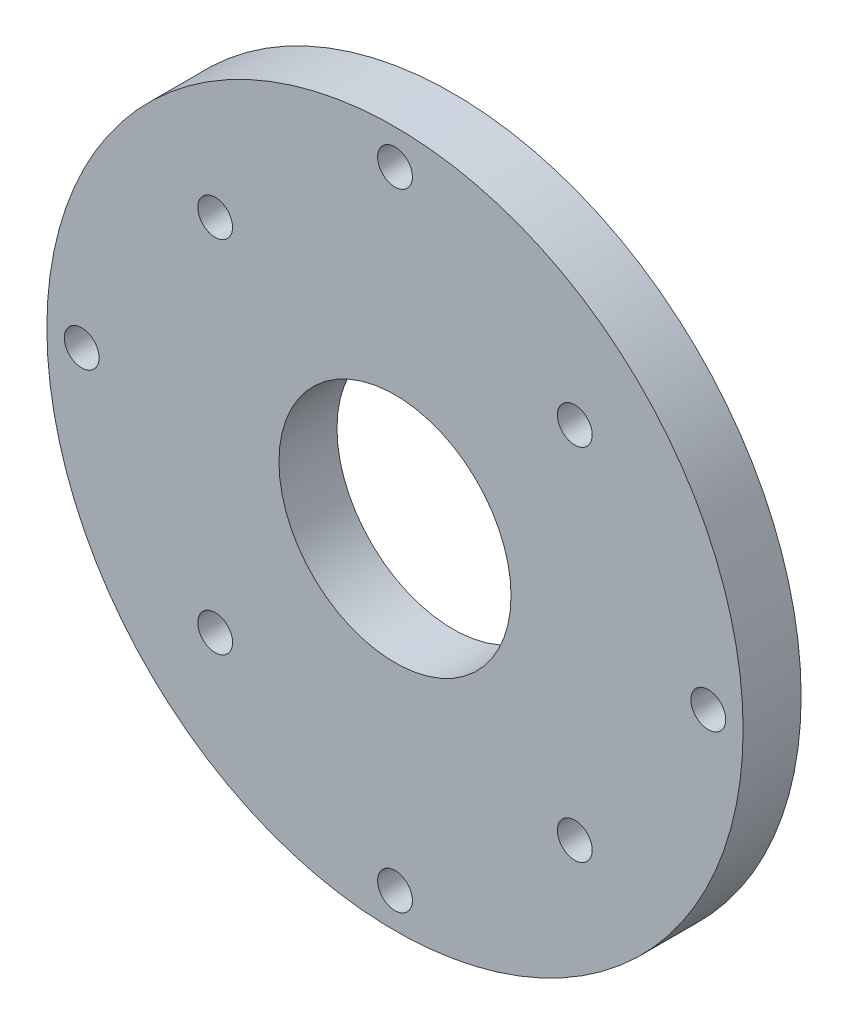
ISO-10303-21;
HEADER;
FILE_DESCRIPTION(('STEP AP214'),'2;1');
FILE_NAME('part.step','',(''),(''),'','','');
FILE_SCHEMA(('AUTOMOTIVE_DESIGN { 1 0 10303 214 1 1 1 1 }'));
ENDSEC;
DATA;
#1=APPLICATION_CONTEXT('core data for automotive mechanical design processes');
#2=APPLICATION_PROTOCOL_DEFINITION('international standard','automotive_design',2000,#1);
#3=PRODUCT_CONTEXT('',#1,'mechanical');
#4=PRODUCT('Part','Part','',(#3));
#5=PRODUCT_RELATED_PRODUCT_CATEGORY('part','',(#4));
#6=PRODUCT_DEFINITION_FORMATION('','',#4);
#7=PRODUCT_DEFINITION_CONTEXT('part definition',#1,'design');
#8=PRODUCT_DEFINITION('design','',#6,#7);
#9=PRODUCT_DEFINITION_SHAPE('','',#8);
#10=(LENGTH_UNIT() NAMED_UNIT(*) SI_UNIT(.MILLI.,.METRE.));
#11=(NAMED_UNIT(*) PLANE_ANGLE_UNIT() SI_UNIT($,.RADIAN.));
#12=(NAMED_UNIT(*) SI_UNIT($,.STERADIAN.) SOLID_ANGLE_UNIT());
#13=UNCERTAINTY_MEASURE_WITH_UNIT(LENGTH_MEASURE(1.E-05),#10,'distance_accuracy_value','');
#14=(GEOMETRIC_REPRESENTATION_CONTEXT(3) GLOBAL_UNCERTAINTY_ASSIGNED_CONTEXT((#13)) GLOBAL_UNIT_ASSIGNED_CONTEXT((#10,
#11,#12)) REPRESENTATION_CONTEXT('',''));
#15=CARTESIAN_POINT('',(0.,0.,0.));
#16=DIRECTION('',(0.,0.,1.));
#17=DIRECTION('',(1.,0.,0.));
#18=AXIS2_PLACEMENT_3D('',#15,#16,#17);
#19=CARTESIAN_POINT('',(0.,0.,5.));
#20=DIRECTION('',(0.,0.,-1.));
#21=DIRECTION('',(-1.,0.,0.));
#22=AXIS2_PLACEMENT_3D('',#19,#20,#21);
#23=CYLINDRICAL_SURFACE('',#22,30.);
#24=CARTESIAN_POINT('',(0.,0.,5.));
#25=DIRECTION('',(0.,0.,1.));
#26=DIRECTION('',(1.,0.,0.));
#27=AXIS2_PLACEMENT_3D('',#24,#25,#26);
#28=CIRCLE('',#27,30.);
#29=CARTESIAN_POINT('',(30.,0.,5.));
#30=VERTEX_POINT('',#29);
#31=EDGE_CURVE('E43',#30,#30,#28,.T.);
#32=ORIENTED_EDGE('',*,*,#31,.F.);
#33=EDGE_LOOP('',(#32));
#34=FACE_BOUND('',#33,.T.);
#35=CARTESIAN_POINT('',(0.,0.,0.));
#36=DIRECTION('',(0.,0.,1.));
#37=DIRECTION('',(1.,0.,0.));
#38=AXIS2_PLACEMENT_3D('',#35,#36,#37);
#39=CIRCLE('',#38,30.);
#40=CARTESIAN_POINT('',(30.,0.,0.));
#41=VERTEX_POINT('',#40);
#42=EDGE_CURVE('E73',#41,#41,#39,.T.);
#43=ORIENTED_EDGE('',*,*,#42,.T.);
#44=EDGE_LOOP('',(#43));
#45=FACE_BOUND('',#44,.T.);
#46=ADVANCED_FACE('F35',(#34,#45),#23,.T.);
#47=CARTESIAN_POINT('',(0.,-27.,5.));
#48=DIRECTION('',(0.,0.,-1.));
#49=DIRECTION('',(-1.,0.,0.));
#50=AXIS2_PLACEMENT_3D('',#47,#48,#49);
#51=CYLINDRICAL_SURFACE('',#50,1.5);
#52=CARTESIAN_POINT('',(0.,-27.,5.));
#53=DIRECTION('',(0.,0.,1.));
#54=DIRECTION('',(1.,0.,0.));
#55=AXIS2_PLACEMENT_3D('',#52,#53,#54);
#56=CIRCLE('',#55,1.5);
#57=CARTESIAN_POINT('',(1.5,-27.,5.));
#58=VERTEX_POINT('',#57);
#59=EDGE_CURVE('E48',#58,#58,#56,.T.);
#60=ORIENTED_EDGE('',*,*,#59,.T.);
#61=EDGE_LOOP('',(#60));
#62=FACE_BOUND('',#61,.T.);
#63=CARTESIAN_POINT('',(0.,-27.,0.));
#64=DIRECTION('',(0.,0.,1.));
#65=DIRECTION('',(1.,0.,0.));
#66=AXIS2_PLACEMENT_3D('',#63,#64,#65);
#67=CIRCLE('',#66,1.5);
#68=CARTESIAN_POINT('',(1.5,-27.,0.));
#69=VERTEX_POINT('',#68);
#70=EDGE_CURVE('E71',#69,#69,#67,.T.);
#71=ORIENTED_EDGE('',*,*,#70,.F.);
#72=EDGE_LOOP('',(#71));
#73=FACE_BOUND('',#72,.T.);
#74=ADVANCED_FACE('F106',(#62,#73),#51,.F.);
#75=CARTESIAN_POINT('',(27.,0.,5.));
#76=DIRECTION('',(0.,0.,-1.));
#77=DIRECTION('',(-1.,0.,0.));
#78=AXIS2_PLACEMENT_3D('',#75,#76,#77);
#79=CYLINDRICAL_SURFACE('',#78,1.5);
#80=CARTESIAN_POINT('',(27.,0.,5.));
#81=DIRECTION('',(0.,0.,1.));
#82=DIRECTION('',(1.,0.,0.));
#83=AXIS2_PLACEMENT_3D('',#80,#81,#82);
#84=CIRCLE('',#83,1.5);
#85=CARTESIAN_POINT('',(28.5,0.,5.));
#86=VERTEX_POINT('',#85);
#87=EDGE_CURVE('E101',#86,#86,#84,.T.);
#88=ORIENTED_EDGE('',*,*,#87,.T.);
#89=EDGE_LOOP('',(#88));
#90=FACE_BOUND('',#89,.T.);
#91=CARTESIAN_POINT('',(27.,0.,0.));
#92=DIRECTION('',(0.,0.,1.));
#93=DIRECTION('',(1.,0.,0.));
#94=AXIS2_PLACEMENT_3D('',#91,#92,#93);
#95=CIRCLE('',#94,1.5);
#96=CARTESIAN_POINT('',(28.5,0.,0.));
#97=VERTEX_POINT('',#96);
#98=EDGE_CURVE('E68',#97,#97,#95,.T.);
#99=ORIENTED_EDGE('',*,*,#98,.F.);
#100=EDGE_LOOP('',(#99));
#101=FACE_BOUND('',#100,.T.);
#102=ADVANCED_FACE('F124',(#90,#101),#79,.F.);
#103=CARTESIAN_POINT('',(0.,27.,5.));
#104=DIRECTION('',(0.,0.,-1.));
#105=DIRECTION('',(-1.,0.,0.));
#106=AXIS2_PLACEMENT_3D('',#103,#104,#105);
#107=CYLINDRICAL_SURFACE('',#106,1.5);
#108=CARTESIAN_POINT('',(0.,27.,5.));
#109=DIRECTION('',(0.,0.,1.));
#110=DIRECTION('',(1.,0.,0.));
#111=AXIS2_PLACEMENT_3D('',#108,#109,#110);
#112=CIRCLE('',#111,1.5);
#113=CARTESIAN_POINT('',(1.5,27.,5.));
#114=VERTEX_POINT('',#113);
#115=EDGE_CURVE('E98',#114,#114,#112,.T.);
#116=ORIENTED_EDGE('',*,*,#115,.T.);
#117=EDGE_LOOP('',(#116));
#118=FACE_BOUND('',#117,.T.);
#119=CARTESIAN_POINT('',(0.,27.,0.));
#120=DIRECTION('',(0.,0.,1.));
#121=DIRECTION('',(1.,0.,0.));
#122=AXIS2_PLACEMENT_3D('',#119,#120,#121);
#123=CIRCLE('',#122,1.5);
#124=CARTESIAN_POINT('',(1.5,27.,0.));
#125=VERTEX_POINT('',#124);
#126=EDGE_CURVE('E65',#125,#125,#123,.T.);
#127=ORIENTED_EDGE('',*,*,#126,.F.);
#128=EDGE_LOOP('',(#127));
#129=FACE_BOUND('',#128,.T.);
#130=ADVANCED_FACE('F131',(#118,#129),#107,.F.);
#131=CARTESIAN_POINT('',(-27.,0.,5.));
#132=DIRECTION('',(0.,0.,-1.));
#133=DIRECTION('',(-1.,0.,0.));
#134=AXIS2_PLACEMENT_3D('',#131,#132,#133);
#135=CYLINDRICAL_SURFACE('',#134,1.5);
#136=CARTESIAN_POINT('',(-27.,0.,5.));
#137=DIRECTION('',(0.,0.,1.));
#138=DIRECTION('',(1.,0.,0.));
#139=AXIS2_PLACEMENT_3D('',#136,#137,#138);
#140=CIRCLE('',#139,1.5);
#141=CARTESIAN_POINT('',(-25.5,0.,5.));
#142=VERTEX_POINT('',#141);
#143=EDGE_CURVE('E95',#142,#142,#140,.T.);
#144=ORIENTED_EDGE('',*,*,#143,.T.);
#145=EDGE_LOOP('',(#144));
#146=FACE_BOUND('',#145,.T.);
#147=CARTESIAN_POINT('',(-27.,0.,0.));
#148=DIRECTION('',(0.,0.,1.));
#149=DIRECTION('',(1.,0.,0.));
#150=AXIS2_PLACEMENT_3D('',#147,#148,#149);
#151=CIRCLE('',#150,1.5);
#152=CARTESIAN_POINT('',(-25.5,0.,0.));
#153=VERTEX_POINT('',#152);
#154=EDGE_CURVE('E62',#153,#153,#151,.T.);
#155=ORIENTED_EDGE('',*,*,#154,.F.);
#156=EDGE_LOOP('',(#155));
#157=FACE_BOUND('',#156,.T.);
#158=ADVANCED_FACE('F135',(#146,#157),#135,.F.);
#159=CARTESIAN_POINT('',(15.495,15.495,5.));
#160=DIRECTION('',(0.,0.,-1.));
#161=DIRECTION('',(-1.,0.,0.));
#162=AXIS2_PLACEMENT_3D('',#159,#160,#161);
#163=CYLINDRICAL_SURFACE('',#162,1.5);
#164=CARTESIAN_POINT('',(15.495,15.495,5.));
#165=DIRECTION('',(0.,0.,1.));
#166=DIRECTION('',(1.,0.,0.));
#167=AXIS2_PLACEMENT_3D('',#164,#165,#166);
#168=CIRCLE('',#167,1.5);
#169=CARTESIAN_POINT('',(16.995,15.495,5.));
#170=VERTEX_POINT('',#169);
#171=EDGE_CURVE('E87',#170,#170,#168,.T.);
#172=ORIENTED_EDGE('',*,*,#171,.T.);
#173=EDGE_LOOP('',(#172));
#174=FACE_BOUND('',#173,.T.);
#175=CARTESIAN_POINT('',(15.495,15.495,0.));
#176=DIRECTION('',(0.,0.,1.));
#177=DIRECTION('',(1.,0.,0.));
#178=AXIS2_PLACEMENT_3D('',#175,#176,#177);
#179=CIRCLE('',#178,1.5);
#180=CARTESIAN_POINT('',(16.995,15.495,0.));
#181=VERTEX_POINT('',#180);
#182=EDGE_CURVE('E59',#181,#181,#179,.T.);
#183=ORIENTED_EDGE('',*,*,#182,.F.);
#184=EDGE_LOOP('',(#183));
#185=FACE_BOUND('',#184,.T.);
#186=ADVANCED_FACE('F139',(#174,#185),#163,.F.);
#187=CARTESIAN_POINT('',(-15.495,15.495,5.));
#188=DIRECTION('',(0.,0.,-1.));
#189=DIRECTION('',(-1.,0.,0.));
#190=AXIS2_PLACEMENT_3D('',#187,#188,#189);
#191=CYLINDRICAL_SURFACE('',#190,1.5);
#192=CARTESIAN_POINT('',(-15.495,15.495,5.));
#193=DIRECTION('',(0.,0.,1.));
#194=DIRECTION('',(1.,0.,0.));
#195=AXIS2_PLACEMENT_3D('',#192,#193,#194);
#196=CIRCLE('',#195,1.5);
#197=CARTESIAN_POINT('',(-13.995,15.495,5.));
#198=VERTEX_POINT('',#197);
#199=EDGE_CURVE('E82',#198,#198,#196,.T.);
#200=ORIENTED_EDGE('',*,*,#199,.T.);
#201=EDGE_LOOP('',(#200));
#202=FACE_BOUND('',#201,.T.);
#203=CARTESIAN_POINT('',(-15.495,15.495,0.));
#204=DIRECTION('',(0.,0.,1.));
#205=DIRECTION('',(1.,0.,0.));
#206=AXIS2_PLACEMENT_3D('',#203,#204,#205);
#207=CIRCLE('',#206,1.5);
#208=CARTESIAN_POINT('',(-13.995,15.495,0.));
#209=VERTEX_POINT('',#208);
#210=EDGE_CURVE('E55',#209,#209,#207,.T.);
#211=ORIENTED_EDGE('',*,*,#210,.F.);
#212=EDGE_LOOP('',(#211));
#213=FACE_BOUND('',#212,.T.);
#214=ADVANCED_FACE('F142',(#202,#213),#191,.F.);
#215=CARTESIAN_POINT('',(15.495,-15.495,5.));
#216=DIRECTION('',(0.,0.,-1.));
#217=DIRECTION('',(-1.,0.,0.));
#218=AXIS2_PLACEMENT_3D('',#215,#216,#217);
#219=CYLINDRICAL_SURFACE('',#218,1.5);
#220=CARTESIAN_POINT('',(15.495,-15.495,5.));
#221=DIRECTION('',(0.,0.,1.));
#222=DIRECTION('',(1.,0.,0.));
#223=AXIS2_PLACEMENT_3D('',#220,#221,#222);
#224=CIRCLE('',#223,1.5);
#225=CARTESIAN_POINT('',(16.995,-15.495,5.));
#226=VERTEX_POINT('',#225);
#227=EDGE_CURVE('E78',#226,#226,#224,.T.);
#228=ORIENTED_EDGE('',*,*,#227,.T.);
#229=EDGE_LOOP('',(#228));
#230=FACE_BOUND('',#229,.T.);
#231=CARTESIAN_POINT('',(15.495,-15.495,0.));
#232=DIRECTION('',(0.,0.,1.));
#233=DIRECTION('',(1.,0.,0.));
#234=AXIS2_PLACEMENT_3D('',#231,#232,#233);
#235=CIRCLE('',#234,1.5);
#236=CARTESIAN_POINT('',(16.995,-15.495,0.));
#237=VERTEX_POINT('',#236);
#238=EDGE_CURVE('E52',#237,#237,#235,.T.);
#239=ORIENTED_EDGE('',*,*,#238,.F.);
#240=EDGE_LOOP('',(#239));
#241=FACE_BOUND('',#240,.T.);
#242=ADVANCED_FACE('F37',(#230,#241),#219,.F.);
#243=CARTESIAN_POINT('',(-15.495,-15.495,5.));
#244=DIRECTION('',(0.,0.,-1.));
#245=DIRECTION('',(-1.,0.,0.));
#246=AXIS2_PLACEMENT_3D('',#243,#244,#245);
#247=CYLINDRICAL_SURFACE('',#246,1.5);
#248=CARTESIAN_POINT('',(-15.495,-15.495,5.));
#249=DIRECTION('',(0.,0.,1.));
#250=DIRECTION('',(1.,0.,0.));
#251=AXIS2_PLACEMENT_3D('',#248,#249,#250);
#252=CIRCLE('',#251,1.5);
#253=CARTESIAN_POINT('',(-13.995,-15.495,5.));
#254=VERTEX_POINT('',#253);
#255=EDGE_CURVE('E10',#254,#254,#252,.T.);
#256=ORIENTED_EDGE('',*,*,#255,.T.);
#257=EDGE_LOOP('',(#256));
#258=FACE_BOUND('',#257,.T.);
#259=CARTESIAN_POINT('',(-15.495,-15.495,0.));
#260=DIRECTION('',(0.,0.,1.));
#261=DIRECTION('',(1.,0.,0.));
#262=AXIS2_PLACEMENT_3D('',#259,#260,#261);
#263=CIRCLE('',#262,1.5);
#264=CARTESIAN_POINT('',(-13.995,-15.495,0.));
#265=VERTEX_POINT('',#264);
#266=EDGE_CURVE('E39',#265,#265,#263,.T.);
#267=ORIENTED_EDGE('',*,*,#266,.F.);
#268=EDGE_LOOP('',(#267));
#269=FACE_BOUND('',#268,.T.);
#270=ADVANCED_FACE('F113',(#258,#269),#247,.F.);
#271=CARTESIAN_POINT('',(0.,0.,5.));
#272=DIRECTION('',(0.,0.,1.));
#273=DIRECTION('',(1.,0.,0.));
#274=AXIS2_PLACEMENT_3D('',#271,#272,#273);
#275=PLANE('',#274);
#276=CARTESIAN_POINT('',(0.,0.,5.));
#277=DIRECTION('',(0.,0.,1.));
#278=DIRECTION('',(1.,0.,0.));
#279=AXIS2_PLACEMENT_3D('',#276,#277,#278);
#280=CIRCLE('',#279,10.);
#281=CARTESIAN_POINT('',(10.,0.,5.));
#282=VERTEX_POINT('',#281);
#283=EDGE_CURVE('E90',#282,#282,#280,.T.);
#284=ORIENTED_EDGE('',*,*,#283,.F.);
#285=EDGE_LOOP('',(#284));
#286=FACE_BOUND('',#285,.T.);
#287=ORIENTED_EDGE('',*,*,#227,.F.);
#288=EDGE_LOOP('',(#287));
#289=FACE_BOUND('',#288,.T.);
#290=ORIENTED_EDGE('',*,*,#199,.F.);
#291=EDGE_LOOP('',(#290));
#292=FACE_BOUND('',#291,.T.);
#293=ORIENTED_EDGE('',*,*,#171,.F.);
#294=EDGE_LOOP('',(#293));
#295=FACE_BOUND('',#294,.T.);
#296=ORIENTED_EDGE('',*,*,#143,.F.);
#297=EDGE_LOOP('',(#296));
#298=FACE_BOUND('',#297,.T.);
#299=ORIENTED_EDGE('',*,*,#115,.F.);
#300=EDGE_LOOP('',(#299));
#301=FACE_BOUND('',#300,.T.);
#302=ORIENTED_EDGE('',*,*,#87,.F.);
#303=EDGE_LOOP('',(#302));
#304=FACE_BOUND('',#303,.T.);
#305=ORIENTED_EDGE('',*,*,#59,.F.);
#306=EDGE_LOOP('',(#305));
#307=FACE_BOUND('',#306,.T.);
#308=ORIENTED_EDGE('',*,*,#31,.T.);
#309=EDGE_LOOP('',(#308));
#310=FACE_BOUND('',#309,.T.);
#311=ORIENTED_EDGE('',*,*,#255,.F.);
#312=EDGE_LOOP('',(#311));
#313=FACE_BOUND('',#312,.T.);
#314=ADVANCED_FACE('F109',(#286,#289,#292,#295,#298,#301,#304,#307,#310,#313),#275,.T.);
#315=CARTESIAN_POINT('',(0.,0.,0.));
#316=DIRECTION('',(0.,0.,1.));
#317=DIRECTION('',(1.,0.,0.));
#318=AXIS2_PLACEMENT_3D('',#315,#316,#317);
#319=PLANE('',#318);
#320=CARTESIAN_POINT('',(0.,0.,0.));
#321=DIRECTION('',(0.,0.,1.));
#322=DIRECTION('',(1.,0.,0.));
#323=AXIS2_PLACEMENT_3D('',#320,#321,#322);
#324=CIRCLE('',#323,10.);
#325=CARTESIAN_POINT('',(10.,0.,0.));
#326=VERTEX_POINT('',#325);
#327=EDGE_CURVE('E56',#326,#326,#324,.T.);
#328=ORIENTED_EDGE('',*,*,#327,.T.);
#329=EDGE_LOOP('',(#328));
#330=FACE_BOUND('',#329,.T.);
#331=ORIENTED_EDGE('',*,*,#238,.T.);
#332=EDGE_LOOP('',(#331));
#333=FACE_BOUND('',#332,.T.);
#334=ORIENTED_EDGE('',*,*,#210,.T.);
#335=EDGE_LOOP('',(#334));
#336=FACE_BOUND('',#335,.T.);
#337=ORIENTED_EDGE('',*,*,#182,.T.);
#338=EDGE_LOOP('',(#337));
#339=FACE_BOUND('',#338,.T.);
#340=ORIENTED_EDGE('',*,*,#154,.T.);
#341=EDGE_LOOP('',(#340));
#342=FACE_BOUND('',#341,.T.);
#343=ORIENTED_EDGE('',*,*,#126,.T.);
#344=EDGE_LOOP('',(#343));
#345=FACE_BOUND('',#344,.T.);
#346=ORIENTED_EDGE('',*,*,#98,.T.);
#347=EDGE_LOOP('',(#346));
#348=FACE_BOUND('',#347,.T.);
#349=ORIENTED_EDGE('',*,*,#70,.T.);
#350=EDGE_LOOP('',(#349));
#351=FACE_BOUND('',#350,.T.);
#352=ORIENTED_EDGE('',*,*,#42,.F.);
#353=EDGE_LOOP('',(#352));
#354=FACE_BOUND('',#353,.T.);
#355=ORIENTED_EDGE('',*,*,#266,.T.);
#356=EDGE_LOOP('',(#355));
#357=FACE_BOUND('',#356,.T.);
#358=ADVANCED_FACE('F112',(#330,#333,#336,#339,#342,#345,#348,#351,#354,#357),#319,.F.);
#359=CARTESIAN_POINT('',(0.,0.,0.));
#360=DIRECTION('',(0.,0.,1.));
#361=DIRECTION('',(1.,0.,0.));
#362=AXIS2_PLACEMENT_3D('',#359,#360,#361);
#363=CYLINDRICAL_SURFACE('',#362,10.);
#364=ORIENTED_EDGE('',*,*,#327,.F.);
#365=EDGE_LOOP('',(#364));
#366=FACE_BOUND('',#365,.T.);
#367=ORIENTED_EDGE('',*,*,#283,.T.);
#368=EDGE_LOOP('',(#367));
#369=FACE_BOUND('',#368,.T.);
#370=ADVANCED_FACE('F155',(#366,#369),#363,.F.);
#371=CLOSED_SHELL('',(#46,#74,#102,#130,#158,#186,#214,#242,#270,#314,#358,#370));
#372=MANIFOLD_SOLID_BREP('B2',#371);
#373=ADVANCED_BREP_SHAPE_REPRESENTATION('',(#18,#372),#14);
#374=SHAPE_DEFINITION_REPRESENTATION(#9,#373);
ENDSEC;
END-ISO-10303-21;
